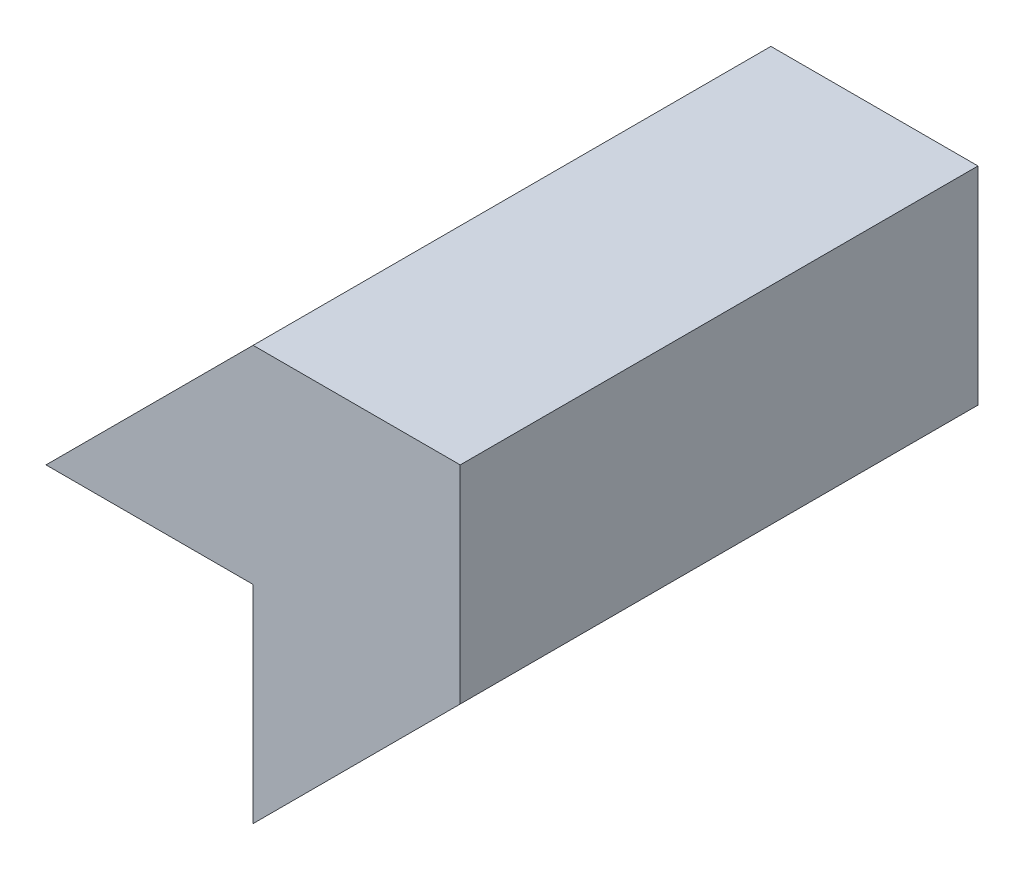
ISO-10303-21;
HEADER;
FILE_DESCRIPTION(('STEP AP214'),'2;1');
FILE_NAME('part.step','',(''),(''),'','','');
FILE_SCHEMA(('AUTOMOTIVE_DESIGN { 1 0 10303 214 1 1 1 1 }'));
ENDSEC;
DATA;
#1=APPLICATION_CONTEXT('core data for automotive mechanical design processes');
#2=APPLICATION_PROTOCOL_DEFINITION('international standard','automotive_design',2000,#1);
#3=PRODUCT_CONTEXT('',#1,'mechanical');
#4=PRODUCT('Part','Part','',(#3));
#5=PRODUCT_RELATED_PRODUCT_CATEGORY('part','',(#4));
#6=PRODUCT_DEFINITION_FORMATION('','',#4);
#7=PRODUCT_DEFINITION_CONTEXT('part definition',#1,'design');
#8=PRODUCT_DEFINITION('design','',#6,#7);
#9=PRODUCT_DEFINITION_SHAPE('','',#8);
#10=(LENGTH_UNIT() NAMED_UNIT(*) SI_UNIT(.MILLI.,.METRE.));
#11=(NAMED_UNIT(*) PLANE_ANGLE_UNIT() SI_UNIT($,.RADIAN.));
#12=(NAMED_UNIT(*) SI_UNIT($,.STERADIAN.) SOLID_ANGLE_UNIT());
#13=UNCERTAINTY_MEASURE_WITH_UNIT(LENGTH_MEASURE(1.E-05),#10,'distance_accuracy_value','');
#14=(GEOMETRIC_REPRESENTATION_CONTEXT(3) GLOBAL_UNCERTAINTY_ASSIGNED_CONTEXT((#13)) GLOBAL_UNIT_ASSIGNED_CONTEXT((#10,
#11,#12)) REPRESENTATION_CONTEXT('',''));
#15=CARTESIAN_POINT('',(0.,0.,0.));
#16=DIRECTION('',(0.,0.,1.));
#17=DIRECTION('',(1.,0.,0.));
#18=AXIS2_PLACEMENT_3D('',#15,#16,#17);
#19=CARTESIAN_POINT('',(-10.,-9.99999999999999,25.));
#20=DIRECTION('',(0.,1.,0.));
#21=DIRECTION('',(0.,0.,1.));
#22=AXIS2_PLACEMENT_3D('',#19,#20,#21);
#23=PLANE('',#22);
#24=DIRECTION('',(1.,0.,0.));
#25=VECTOR('',#24,1.);
#26=CARTESIAN_POINT('',(-10.,-9.99999999999999,0.));
#27=LINE('',#26,#25);
#28=CARTESIAN_POINT('',(-20.,-9.99999999999999,0.));
#29=VERTEX_POINT('',#28);
#30=CARTESIAN_POINT('',(-10.,-9.99999999999999,0.));
#31=VERTEX_POINT('',#30);
#32=EDGE_CURVE('E117',#29,#31,#27,.T.);
#33=ORIENTED_EDGE('',*,*,#32,.T.);
#34=DIRECTION('',(0.,0.,-1.));
#35=VECTOR('',#34,1.);
#36=CARTESIAN_POINT('',(-10.,-9.99999999999999,25.));
#37=LINE('',#36,#35);
#38=CARTESIAN_POINT('',(-10.,-9.99999999999999,25.));
#39=VERTEX_POINT('',#38);
#40=EDGE_CURVE('E11',#39,#31,#37,.T.);
#41=ORIENTED_EDGE('',*,*,#40,.F.);
#42=DIRECTION('',(1.,0.,0.));
#43=VECTOR('',#42,1.);
#44=CARTESIAN_POINT('',(-10.,-9.99999999999999,25.));
#45=LINE('',#44,#43);
#46=CARTESIAN_POINT('',(-20.,-9.99999999999999,25.));
#47=VERTEX_POINT('',#46);
#48=EDGE_CURVE('E127',#47,#39,#45,.T.);
#49=ORIENTED_EDGE('',*,*,#48,.F.);
#50=DIRECTION('',(0.,0.,-1.));
#51=VECTOR('',#50,1.);
#52=CARTESIAN_POINT('',(-20.,-9.99999999999999,25.));
#53=LINE('',#52,#51);
#54=EDGE_CURVE('E113',#47,#29,#53,.T.);
#55=ORIENTED_EDGE('',*,*,#54,.T.);
#56=EDGE_LOOP('',(#33,#41,#49,#55));
#57=FACE_BOUND('',#56,.T.);
#58=ADVANCED_FACE('F33',(#57),#23,.F.);
#59=CARTESIAN_POINT('',(-10.,-20.,25.));
#60=DIRECTION('',(1.,0.,0.));
#61=DIRECTION('',(0.,0.,-1.));
#62=AXIS2_PLACEMENT_3D('',#59,#60,#61);
#63=PLANE('',#62);
#64=DIRECTION('',(0.,-1.,0.));
#65=VECTOR('',#64,1.);
#66=CARTESIAN_POINT('',(-10.,-20.,0.));
#67=LINE('',#66,#65);
#68=CARTESIAN_POINT('',(-10.,-20.,0.));
#69=VERTEX_POINT('',#68);
#70=EDGE_CURVE('E120',#31,#69,#67,.T.);
#71=ORIENTED_EDGE('',*,*,#70,.T.);
#72=DIRECTION('',(0.,0.,-1.));
#73=VECTOR('',#72,1.);
#74=CARTESIAN_POINT('',(-10.,-20.,25.));
#75=LINE('',#74,#73);
#76=CARTESIAN_POINT('',(-10.,-20.,25.));
#77=VERTEX_POINT('',#76);
#78=EDGE_CURVE('E41',#77,#69,#75,.T.);
#79=ORIENTED_EDGE('',*,*,#78,.F.);
#80=DIRECTION('',(0.,-1.,0.));
#81=VECTOR('',#80,1.);
#82=CARTESIAN_POINT('',(-10.,-20.,25.));
#83=LINE('',#82,#81);
#84=EDGE_CURVE('E86',#39,#77,#83,.T.);
#85=ORIENTED_EDGE('',*,*,#84,.F.);
#86=ORIENTED_EDGE('',*,*,#40,.T.);
#87=EDGE_LOOP('',(#71,#79,#85,#86));
#88=FACE_BOUND('',#87,.T.);
#89=ADVANCED_FACE('F151',(#88),#63,.F.);
#90=CARTESIAN_POINT('',(0.,-9.99999999999999,25.));
#91=DIRECTION('',(-0.707106781186548,0.707106781186547,0.));
#92=DIRECTION('',(-0.707106781186547,-0.707106781186548,0.));
#93=AXIS2_PLACEMENT_3D('',#90,#91,#92);
#94=PLANE('',#93);
#95=DIRECTION('',(0.707106781186547,0.707106781186548,0.));
#96=VECTOR('',#95,1.);
#97=CARTESIAN_POINT('',(0.,-9.99999999999999,0.));
#98=LINE('',#97,#96);
#99=CARTESIAN_POINT('',(0.,-9.99999999999999,0.));
#100=VERTEX_POINT('',#99);
#101=EDGE_CURVE('E122',#69,#100,#98,.T.);
#102=ORIENTED_EDGE('',*,*,#101,.T.);
#103=DIRECTION('',(0.,0.,-1.));
#104=VECTOR('',#103,1.);
#105=CARTESIAN_POINT('',(0.,-9.99999999999999,25.));
#106=LINE('',#105,#104);
#107=CARTESIAN_POINT('',(0.,-9.99999999999999,25.));
#108=VERTEX_POINT('',#107);
#109=EDGE_CURVE('E108',#108,#100,#106,.T.);
#110=ORIENTED_EDGE('',*,*,#109,.F.);
#111=DIRECTION('',(0.707106781186547,0.707106781186548,0.));
#112=VECTOR('',#111,1.);
#113=CARTESIAN_POINT('',(0.,-9.99999999999999,25.));
#114=LINE('',#113,#112);
#115=EDGE_CURVE('E99',#77,#108,#114,.T.);
#116=ORIENTED_EDGE('',*,*,#115,.F.);
#117=ORIENTED_EDGE('',*,*,#78,.T.);
#118=EDGE_LOOP('',(#102,#110,#116,#117));
#119=FACE_BOUND('',#118,.T.);
#120=ADVANCED_FACE('F133',(#119),#94,.F.);
#121=CARTESIAN_POINT('',(0.,0.,25.));
#122=DIRECTION('',(-1.,0.,0.));
#123=DIRECTION('',(0.,0.,1.));
#124=AXIS2_PLACEMENT_3D('',#121,#122,#123);
#125=PLANE('',#124);
#126=DIRECTION('',(0.,1.,0.));
#127=VECTOR('',#126,1.);
#128=CARTESIAN_POINT('',(0.,0.,0.));
#129=LINE('',#128,#127);
#130=CARTESIAN_POINT('',(0.,0.,0.));
#131=VERTEX_POINT('',#130);
#132=EDGE_CURVE('E107',#100,#131,#129,.T.);
#133=ORIENTED_EDGE('',*,*,#132,.T.);
#134=DIRECTION('',(0.,0.,-1.));
#135=VECTOR('',#134,1.);
#136=CARTESIAN_POINT('',(0.,0.,25.));
#137=LINE('',#136,#135);
#138=CARTESIAN_POINT('',(0.,0.,25.));
#139=VERTEX_POINT('',#138);
#140=EDGE_CURVE('E104',#139,#131,#137,.T.);
#141=ORIENTED_EDGE('',*,*,#140,.F.);
#142=DIRECTION('',(0.,1.,0.));
#143=VECTOR('',#142,1.);
#144=CARTESIAN_POINT('',(0.,0.,25.));
#145=LINE('',#144,#143);
#146=EDGE_CURVE('E93',#108,#139,#145,.T.);
#147=ORIENTED_EDGE('',*,*,#146,.F.);
#148=ORIENTED_EDGE('',*,*,#109,.T.);
#149=EDGE_LOOP('',(#133,#141,#147,#148));
#150=FACE_BOUND('',#149,.T.);
#151=ADVANCED_FACE('F105',(#150),#125,.F.);
#152=CARTESIAN_POINT('',(-10.,0.,25.));
#153=DIRECTION('',(0.,-1.,0.));
#154=DIRECTION('',(0.,0.,-1.));
#155=AXIS2_PLACEMENT_3D('',#152,#153,#154);
#156=PLANE('',#155);
#157=DIRECTION('',(-1.,0.,0.));
#158=VECTOR('',#157,1.);
#159=CARTESIAN_POINT('',(-10.,0.,0.));
#160=LINE('',#159,#158);
#161=CARTESIAN_POINT('',(-10.,0.,0.));
#162=VERTEX_POINT('',#161);
#163=EDGE_CURVE('E72',#131,#162,#160,.T.);
#164=ORIENTED_EDGE('',*,*,#163,.T.);
#165=DIRECTION('',(0.,0.,-1.));
#166=VECTOR('',#165,1.);
#167=CARTESIAN_POINT('',(-10.,0.,25.));
#168=LINE('',#167,#166);
#169=CARTESIAN_POINT('',(-10.,0.,25.));
#170=VERTEX_POINT('',#169);
#171=EDGE_CURVE('E109',#170,#162,#168,.T.);
#172=ORIENTED_EDGE('',*,*,#171,.F.);
#173=DIRECTION('',(-1.,0.,0.));
#174=VECTOR('',#173,1.);
#175=CARTESIAN_POINT('',(-10.,0.,25.));
#176=LINE('',#175,#174);
#177=EDGE_CURVE('E97',#139,#170,#176,.T.);
#178=ORIENTED_EDGE('',*,*,#177,.F.);
#179=ORIENTED_EDGE('',*,*,#140,.T.);
#180=EDGE_LOOP('',(#164,#172,#178,#179));
#181=FACE_BOUND('',#180,.T.);
#182=ADVANCED_FACE('F111',(#181),#156,.F.);
#183=CARTESIAN_POINT('',(-20.,-9.99999999999999,25.));
#184=DIRECTION('',(0.707106781186548,-0.707106781186547,0.));
#185=DIRECTION('',(0.707106781186547,0.707106781186548,0.));
#186=AXIS2_PLACEMENT_3D('',#183,#184,#185);
#187=PLANE('',#186);
#188=DIRECTION('',(-0.707106781186547,-0.707106781186548,0.));
#189=VECTOR('',#188,1.);
#190=CARTESIAN_POINT('',(-20.,-9.99999999999999,0.));
#191=LINE('',#190,#189);
#192=EDGE_CURVE('E78',#162,#29,#191,.T.);
#193=ORIENTED_EDGE('',*,*,#192,.T.);
#194=ORIENTED_EDGE('',*,*,#54,.F.);
#195=DIRECTION('',(-0.707106781186547,-0.707106781186548,0.));
#196=VECTOR('',#195,1.);
#197=CARTESIAN_POINT('',(-20.,-9.99999999999999,25.));
#198=LINE('',#197,#196);
#199=EDGE_CURVE('E49',#170,#47,#198,.T.);
#200=ORIENTED_EDGE('',*,*,#199,.F.);
#201=ORIENTED_EDGE('',*,*,#171,.T.);
#202=EDGE_LOOP('',(#193,#194,#200,#201));
#203=FACE_BOUND('',#202,.T.);
#204=ADVANCED_FACE('F140',(#203),#187,.F.);
#205=CARTESIAN_POINT('',(0.,0.,25.));
#206=DIRECTION('',(0.,0.,1.));
#207=DIRECTION('',(1.,0.,0.));
#208=AXIS2_PLACEMENT_3D('',#205,#206,#207);
#209=PLANE('',#208);
#210=ORIENTED_EDGE('',*,*,#48,.T.);
#211=ORIENTED_EDGE('',*,*,#84,.T.);
#212=ORIENTED_EDGE('',*,*,#115,.T.);
#213=ORIENTED_EDGE('',*,*,#146,.T.);
#214=ORIENTED_EDGE('',*,*,#177,.T.);
#215=ORIENTED_EDGE('',*,*,#199,.T.);
#216=EDGE_LOOP('',(#210,#211,#212,#213,#214,#215));
#217=FACE_BOUND('',#216,.T.);
#218=ADVANCED_FACE('F95',(#217),#209,.T.);
#219=CARTESIAN_POINT('',(0.,0.,0.));
#220=DIRECTION('',(0.,0.,1.));
#221=DIRECTION('',(1.,0.,0.));
#222=AXIS2_PLACEMENT_3D('',#219,#220,#221);
#223=PLANE('',#222);
#224=ORIENTED_EDGE('',*,*,#32,.F.);
#225=ORIENTED_EDGE('',*,*,#192,.F.);
#226=ORIENTED_EDGE('',*,*,#163,.F.);
#227=ORIENTED_EDGE('',*,*,#132,.F.);
#228=ORIENTED_EDGE('',*,*,#101,.F.);
#229=ORIENTED_EDGE('',*,*,#70,.F.);
#230=EDGE_LOOP('',(#224,#225,#226,#227,#228,#229));
#231=FACE_BOUND('',#230,.T.);
#232=ADVANCED_FACE('F136',(#231),#223,.F.);
#233=CLOSED_SHELL('',(#58,#89,#120,#151,#182,#204,#218,#232));
#234=MANIFOLD_SOLID_BREP('B2',#233);
#235=ADVANCED_BREP_SHAPE_REPRESENTATION('',(#18,#234),#14);
#236=SHAPE_DEFINITION_REPRESENTATION(#9,#235);
ENDSEC;
END-ISO-10303-21;
